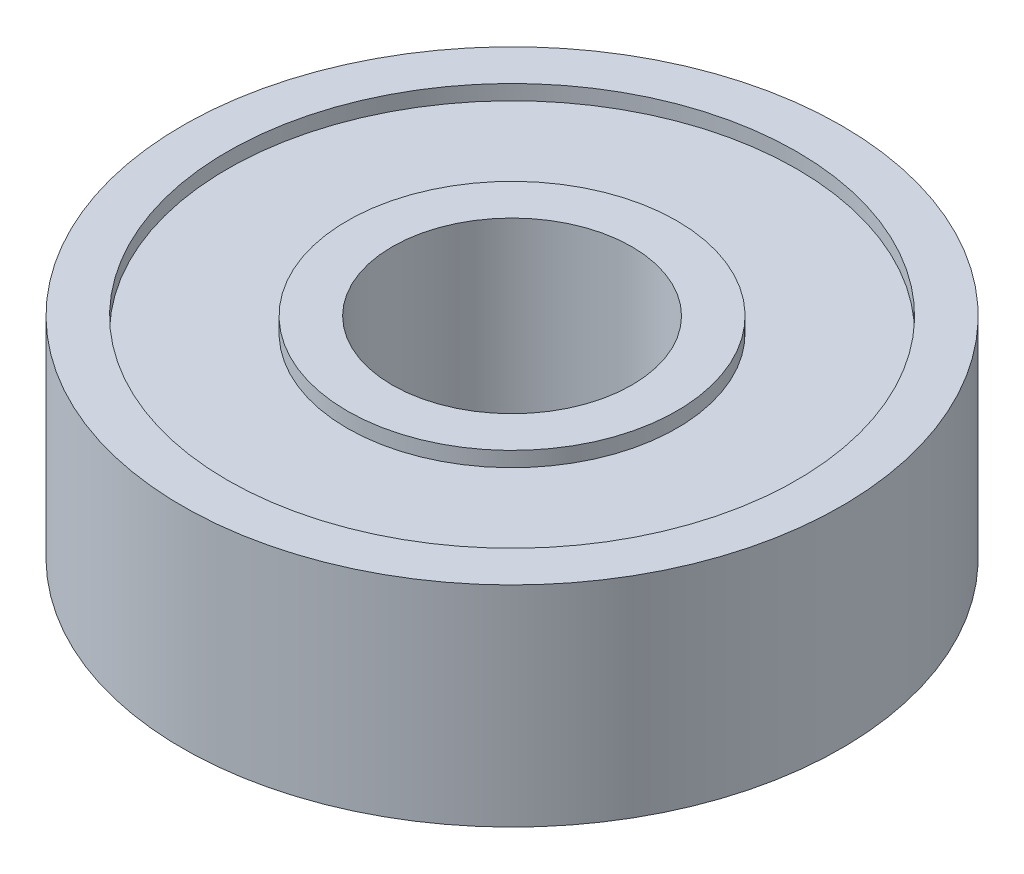
ISO-10303-21;
HEADER;
FILE_DESCRIPTION(('STEP AP214'),'2;1');
FILE_NAME('part.step','',(''),(''),'','','');
FILE_SCHEMA(('AUTOMOTIVE_DESIGN { 1 0 10303 214 1 1 1 1 }'));
ENDSEC;
DATA;
#1=APPLICATION_CONTEXT('core data for automotive mechanical design processes');
#2=APPLICATION_PROTOCOL_DEFINITION('international standard','automotive_design',2000,#1);
#3=PRODUCT_CONTEXT('',#1,'mechanical');
#4=PRODUCT('Part','Part','',(#3));
#5=PRODUCT_RELATED_PRODUCT_CATEGORY('part','',(#4));
#6=PRODUCT_DEFINITION_FORMATION('','',#4);
#7=PRODUCT_DEFINITION_CONTEXT('part definition',#1,'design');
#8=PRODUCT_DEFINITION('design','',#6,#7);
#9=PRODUCT_DEFINITION_SHAPE('','',#8);
#10=(LENGTH_UNIT() NAMED_UNIT(*) SI_UNIT(.MILLI.,.METRE.));
#11=(NAMED_UNIT(*) PLANE_ANGLE_UNIT() SI_UNIT($,.RADIAN.));
#12=(NAMED_UNIT(*) SI_UNIT($,.STERADIAN.) SOLID_ANGLE_UNIT());
#13=UNCERTAINTY_MEASURE_WITH_UNIT(LENGTH_MEASURE(1.E-05),#10,'distance_accuracy_value','');
#14=(GEOMETRIC_REPRESENTATION_CONTEXT(3) GLOBAL_UNCERTAINTY_ASSIGNED_CONTEXT((#13)) GLOBAL_UNIT_ASSIGNED_CONTEXT((#10,
#11,#12)) REPRESENTATION_CONTEXT('',''));
#15=CARTESIAN_POINT('',(0.,0.,0.));
#16=DIRECTION('',(0.,0.,1.));
#17=DIRECTION('',(1.,0.,0.));
#18=AXIS2_PLACEMENT_3D('',#15,#16,#17);
#19=CARTESIAN_POINT('',(0.,-3.36271212391648,0.));
#20=DIRECTION('',(0.,-1.,0.));
#21=DIRECTION('',(0.,0.,-1.));
#22=AXIS2_PLACEMENT_3D('',#19,#20,#21);
#23=CYLINDRICAL_SURFACE('',#22,9.5);
#24=CARTESIAN_POINT('',(0.,3.,0.));
#25=DIRECTION('',(0.,-1.,0.));
#26=DIRECTION('',(0.,0.,-1.));
#27=AXIS2_PLACEMENT_3D('',#24,#25,#26);
#28=CIRCLE('',#27,9.5);
#29=CARTESIAN_POINT('',(0.,3.,-9.5));
#30=VERTEX_POINT('',#29);
#31=EDGE_CURVE('E95',#30,#30,#28,.T.);
#32=ORIENTED_EDGE('',*,*,#31,.T.);
#33=EDGE_LOOP('',(#32));
#34=FACE_BOUND('',#33,.T.);
#35=CARTESIAN_POINT('',(0.,3.5,0.));
#36=DIRECTION('',(0.,-1.,0.));
#37=DIRECTION('',(0.,0.,-1.));
#38=AXIS2_PLACEMENT_3D('',#35,#36,#37);
#39=CIRCLE('',#38,9.5);
#40=CARTESIAN_POINT('',(0.,3.5,-9.5));
#41=VERTEX_POINT('',#40);
#42=EDGE_CURVE('E10',#41,#41,#39,.T.);
#43=ORIENTED_EDGE('',*,*,#42,.F.);
#44=EDGE_LOOP('',(#43));
#45=FACE_BOUND('',#44,.T.);
#46=ADVANCED_FACE('F43',(#34,#45),#23,.F.);
#47=CARTESIAN_POINT('',(0.,3.5,0.));
#48=DIRECTION('',(0.,1.,0.));
#49=DIRECTION('',(0.,0.,1.));
#50=AXIS2_PLACEMENT_3D('',#47,#48,#49);
#51=PLANE('',#50);
#52=ORIENTED_EDGE('',*,*,#42,.T.);
#53=EDGE_LOOP('',(#52));
#54=FACE_BOUND('',#53,.T.);
#55=CARTESIAN_POINT('',(0.,3.5,0.));
#56=DIRECTION('',(0.,-1.,0.));
#57=DIRECTION('',(0.,0.,-1.));
#58=AXIS2_PLACEMENT_3D('',#55,#56,#57);
#59=CIRCLE('',#58,11.);
#60=CARTESIAN_POINT('',(0.,3.5,-11.));
#61=VERTEX_POINT('',#60);
#62=EDGE_CURVE('E51',#61,#61,#59,.T.);
#63=ORIENTED_EDGE('',*,*,#62,.F.);
#64=EDGE_LOOP('',(#63));
#65=FACE_BOUND('',#64,.T.);
#66=ADVANCED_FACE('F45',(#54,#65),#51,.T.);
#67=CARTESIAN_POINT('',(0.,-3.36271212391648,0.));
#68=DIRECTION('',(0.,-1.,0.));
#69=DIRECTION('',(0.,0.,-1.));
#70=AXIS2_PLACEMENT_3D('',#67,#68,#69);
#71=CYLINDRICAL_SURFACE('',#70,11.);
#72=CARTESIAN_POINT('',(0.,-3.5,0.));
#73=DIRECTION('',(0.,-1.,0.));
#74=DIRECTION('',(0.,0.,-1.));
#75=AXIS2_PLACEMENT_3D('',#72,#73,#74);
#76=CIRCLE('',#75,11.);
#77=CARTESIAN_POINT('',(0.,-3.5,-11.));
#78=VERTEX_POINT('',#77);
#79=EDGE_CURVE('E56',#78,#78,#76,.T.);
#80=ORIENTED_EDGE('',*,*,#79,.F.);
#81=EDGE_LOOP('',(#80));
#82=FACE_BOUND('',#81,.T.);
#83=ORIENTED_EDGE('',*,*,#62,.T.);
#84=EDGE_LOOP('',(#83));
#85=FACE_BOUND('',#84,.T.);
#86=ADVANCED_FACE('F120',(#82,#85),#71,.T.);
#87=CARTESIAN_POINT('',(0.,-3.5,0.));
#88=DIRECTION('',(0.,1.,0.));
#89=DIRECTION('',(0.,0.,1.));
#90=AXIS2_PLACEMENT_3D('',#87,#88,#89);
#91=PLANE('',#90);
#92=CARTESIAN_POINT('',(0.,-3.5,0.));
#93=DIRECTION('',(0.,-1.,0.));
#94=DIRECTION('',(0.,0.,-1.));
#95=AXIS2_PLACEMENT_3D('',#92,#93,#94);
#96=CIRCLE('',#95,9.5);
#97=CARTESIAN_POINT('',(0.,-3.5,-9.5));
#98=VERTEX_POINT('',#97);
#99=EDGE_CURVE('E61',#98,#98,#96,.T.);
#100=ORIENTED_EDGE('',*,*,#99,.F.);
#101=EDGE_LOOP('',(#100));
#102=FACE_BOUND('',#101,.T.);
#103=ORIENTED_EDGE('',*,*,#79,.T.);
#104=EDGE_LOOP('',(#103));
#105=FACE_BOUND('',#104,.T.);
#106=ADVANCED_FACE('F125',(#102,#105),#91,.F.);
#107=ORIENTED_EDGE('',*,*,#99,.T.);
#108=EDGE_LOOP('',(#107));
#109=FACE_BOUND('',#108,.T.);
#110=CARTESIAN_POINT('',(0.,-3.,0.));
#111=DIRECTION('',(0.,-1.,0.));
#112=DIRECTION('',(0.,0.,-1.));
#113=AXIS2_PLACEMENT_3D('',#110,#111,#112);
#114=CIRCLE('',#113,9.5);
#115=CARTESIAN_POINT('',(0.,-3.,-9.5));
#116=VERTEX_POINT('',#115);
#117=EDGE_CURVE('E67',#116,#116,#114,.T.);
#118=ORIENTED_EDGE('',*,*,#117,.F.);
#119=EDGE_LOOP('',(#118));
#120=FACE_BOUND('',#119,.T.);
#121=ADVANCED_FACE('F116',(#109,#120),#23,.F.);
#122=CARTESIAN_POINT('',(0.,-3.,0.));
#123=DIRECTION('',(0.,1.,0.));
#124=DIRECTION('',(0.,0.,1.));
#125=AXIS2_PLACEMENT_3D('',#122,#123,#124);
#126=PLANE('',#125);
#127=CARTESIAN_POINT('',(0.,-3.,0.));
#128=DIRECTION('',(0.,-1.,0.));
#129=DIRECTION('',(0.,0.,-1.));
#130=AXIS2_PLACEMENT_3D('',#127,#128,#129);
#131=CIRCLE('',#130,5.5);
#132=CARTESIAN_POINT('',(0.,-3.,-5.5));
#133=VERTEX_POINT('',#132);
#134=EDGE_CURVE('E71',#133,#133,#131,.T.);
#135=ORIENTED_EDGE('',*,*,#134,.F.);
#136=EDGE_LOOP('',(#135));
#137=FACE_BOUND('',#136,.T.);
#138=ORIENTED_EDGE('',*,*,#117,.T.);
#139=EDGE_LOOP('',(#138));
#140=FACE_BOUND('',#139,.T.);
#141=ADVANCED_FACE('F124',(#137,#140),#126,.F.);
#142=CARTESIAN_POINT('',(0.,-3.36271212391648,0.));
#143=DIRECTION('',(0.,-1.,0.));
#144=DIRECTION('',(0.,0.,-1.));
#145=AXIS2_PLACEMENT_3D('',#142,#143,#144);
#146=CYLINDRICAL_SURFACE('',#145,5.5);
#147=CARTESIAN_POINT('',(0.,-3.5,0.));
#148=DIRECTION('',(0.,-1.,0.));
#149=DIRECTION('',(0.,0.,-1.));
#150=AXIS2_PLACEMENT_3D('',#147,#148,#149);
#151=CIRCLE('',#150,5.5);
#152=CARTESIAN_POINT('',(0.,-3.5,-5.5));
#153=VERTEX_POINT('',#152);
#154=EDGE_CURVE('E75',#153,#153,#151,.T.);
#155=ORIENTED_EDGE('',*,*,#154,.F.);
#156=EDGE_LOOP('',(#155));
#157=FACE_BOUND('',#156,.T.);
#158=ORIENTED_EDGE('',*,*,#134,.T.);
#159=EDGE_LOOP('',(#158));
#160=FACE_BOUND('',#159,.T.);
#161=ADVANCED_FACE('F113',(#157,#160),#146,.T.);
#162=CARTESIAN_POINT('',(0.,-3.5,0.));
#163=DIRECTION('',(0.,1.,0.));
#164=DIRECTION('',(0.,0.,1.));
#165=AXIS2_PLACEMENT_3D('',#162,#163,#164);
#166=PLANE('',#165);
#167=CARTESIAN_POINT('',(0.,-3.5,0.));
#168=DIRECTION('',(0.,-1.,0.));
#169=DIRECTION('',(0.,0.,-1.));
#170=AXIS2_PLACEMENT_3D('',#167,#168,#169);
#171=CIRCLE('',#170,4.);
#172=CARTESIAN_POINT('',(0.,-3.5,-4.));
#173=VERTEX_POINT('',#172);
#174=EDGE_CURVE('E79',#173,#173,#171,.T.);
#175=ORIENTED_EDGE('',*,*,#174,.F.);
#176=EDGE_LOOP('',(#175));
#177=FACE_BOUND('',#176,.T.);
#178=ORIENTED_EDGE('',*,*,#154,.T.);
#179=EDGE_LOOP('',(#178));
#180=FACE_BOUND('',#179,.T.);
#181=ADVANCED_FACE('F173',(#177,#180),#166,.F.);
#182=CARTESIAN_POINT('',(0.,-3.36271212391648,0.));
#183=DIRECTION('',(0.,-1.,0.));
#184=DIRECTION('',(0.,0.,-1.));
#185=AXIS2_PLACEMENT_3D('',#182,#183,#184);
#186=CYLINDRICAL_SURFACE('',#185,4.);
#187=ORIENTED_EDGE('',*,*,#174,.T.);
#188=EDGE_LOOP('',(#187));
#189=FACE_BOUND('',#188,.T.);
#190=CARTESIAN_POINT('',(0.,3.5,0.));
#191=DIRECTION('',(0.,-1.,0.));
#192=DIRECTION('',(0.,0.,-1.));
#193=AXIS2_PLACEMENT_3D('',#190,#191,#192);
#194=CIRCLE('',#193,4.);
#195=CARTESIAN_POINT('',(0.,3.5,-4.));
#196=VERTEX_POINT('',#195);
#197=EDGE_CURVE('E83',#196,#196,#194,.T.);
#198=ORIENTED_EDGE('',*,*,#197,.F.);
#199=EDGE_LOOP('',(#198));
#200=FACE_BOUND('',#199,.T.);
#201=ADVANCED_FACE('F185',(#189,#200),#186,.F.);
#202=CARTESIAN_POINT('',(0.,3.5,0.));
#203=DIRECTION('',(0.,1.,0.));
#204=DIRECTION('',(0.,0.,1.));
#205=AXIS2_PLACEMENT_3D('',#202,#203,#204);
#206=PLANE('',#205);
#207=ORIENTED_EDGE('',*,*,#197,.T.);
#208=EDGE_LOOP('',(#207));
#209=FACE_BOUND('',#208,.T.);
#210=CARTESIAN_POINT('',(0.,3.5,0.));
#211=DIRECTION('',(0.,-1.,0.));
#212=DIRECTION('',(0.,0.,-1.));
#213=AXIS2_PLACEMENT_3D('',#210,#211,#212);
#214=CIRCLE('',#213,5.5);
#215=CARTESIAN_POINT('',(0.,3.5,-5.5));
#216=VERTEX_POINT('',#215);
#217=EDGE_CURVE('E87',#216,#216,#214,.T.);
#218=ORIENTED_EDGE('',*,*,#217,.F.);
#219=EDGE_LOOP('',(#218));
#220=FACE_BOUND('',#219,.T.);
#221=ADVANCED_FACE('F110',(#209,#220),#206,.T.);
#222=CARTESIAN_POINT('',(0.,3.,0.));
#223=DIRECTION('',(0.,-1.,0.));
#224=DIRECTION('',(0.,0.,-1.));
#225=AXIS2_PLACEMENT_3D('',#222,#223,#224);
#226=CIRCLE('',#225,5.5);
#227=CARTESIAN_POINT('',(0.,3.,-5.5));
#228=VERTEX_POINT('',#227);
#229=EDGE_CURVE('E91',#228,#228,#226,.T.);
#230=ORIENTED_EDGE('',*,*,#229,.F.);
#231=EDGE_LOOP('',(#230));
#232=FACE_BOUND('',#231,.T.);
#233=ORIENTED_EDGE('',*,*,#217,.T.);
#234=EDGE_LOOP('',(#233));
#235=FACE_BOUND('',#234,.T.);
#236=ADVANCED_FACE('F104',(#232,#235),#146,.T.);
#237=CARTESIAN_POINT('',(0.,3.,0.));
#238=DIRECTION('',(0.,1.,0.));
#239=DIRECTION('',(0.,0.,1.));
#240=AXIS2_PLACEMENT_3D('',#237,#238,#239);
#241=PLANE('',#240);
#242=ORIENTED_EDGE('',*,*,#229,.T.);
#243=EDGE_LOOP('',(#242));
#244=FACE_BOUND('',#243,.T.);
#245=ORIENTED_EDGE('',*,*,#31,.F.);
#246=EDGE_LOOP('',(#245));
#247=FACE_BOUND('',#246,.T.);
#248=ADVANCED_FACE('F102',(#244,#247),#241,.T.);
#249=CLOSED_SHELL('',(#46,#66,#86,#106,#121,#141,#161,#181,#201,#221,#236,#248));
#250=MANIFOLD_SOLID_BREP('B2',#249);
#251=ADVANCED_BREP_SHAPE_REPRESENTATION('',(#18,#250),#14);
#252=SHAPE_DEFINITION_REPRESENTATION(#9,#251);
ENDSEC;
END-ISO-10303-21;
